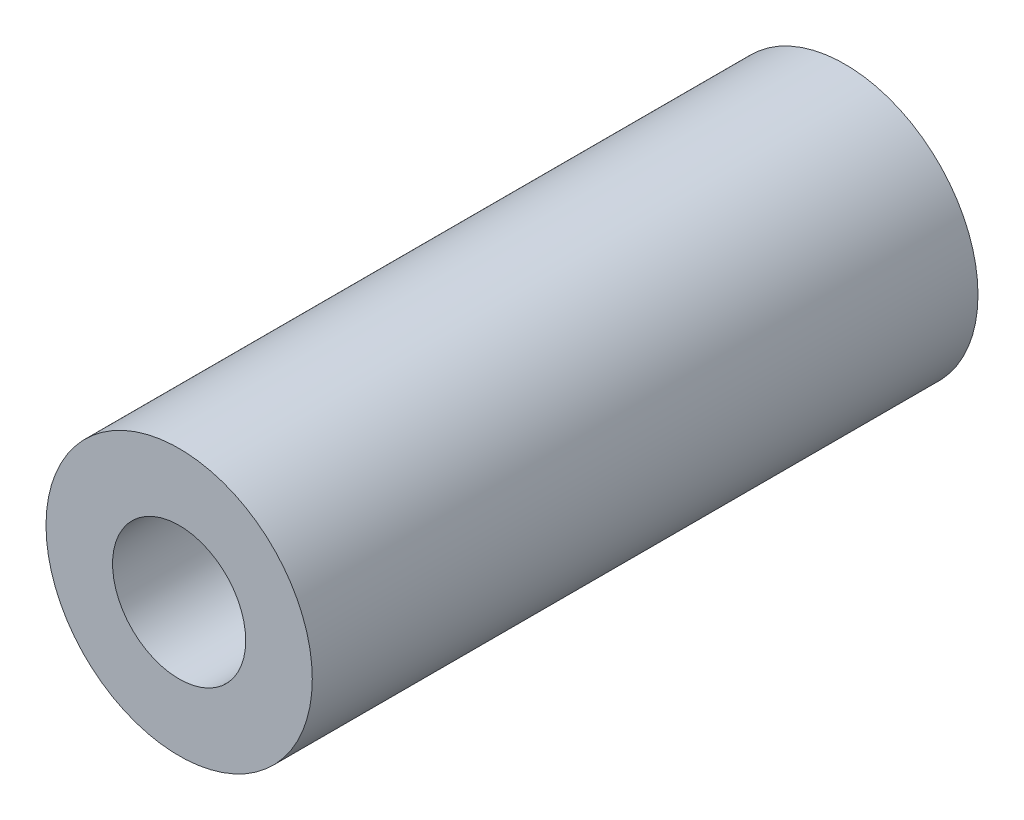
ISO-10303-21;
HEADER;
FILE_DESCRIPTION(('STEP AP214'),'2;1');
FILE_NAME('part.step','',(''),(''),'','','');
FILE_SCHEMA(('AUTOMOTIVE_DESIGN { 1 0 10303 214 1 1 1 1 }'));
ENDSEC;
DATA;
#1=APPLICATION_CONTEXT('core data for automotive mechanical design processes');
#2=APPLICATION_PROTOCOL_DEFINITION('international standard','automotive_design',2000,#1);
#3=PRODUCT_CONTEXT('',#1,'mechanical');
#4=PRODUCT('Part','Part','',(#3));
#5=PRODUCT_RELATED_PRODUCT_CATEGORY('part','',(#4));
#6=PRODUCT_DEFINITION_FORMATION('','',#4);
#7=PRODUCT_DEFINITION_CONTEXT('part definition',#1,'design');
#8=PRODUCT_DEFINITION('design','',#6,#7);
#9=PRODUCT_DEFINITION_SHAPE('','',#8);
#10=(LENGTH_UNIT() NAMED_UNIT(*) SI_UNIT(.MILLI.,.METRE.));
#11=(NAMED_UNIT(*) PLANE_ANGLE_UNIT() SI_UNIT($,.RADIAN.));
#12=(NAMED_UNIT(*) SI_UNIT($,.STERADIAN.) SOLID_ANGLE_UNIT());
#13=UNCERTAINTY_MEASURE_WITH_UNIT(LENGTH_MEASURE(1.E-05),#10,'distance_accuracy_value','');
#14=(GEOMETRIC_REPRESENTATION_CONTEXT(3) GLOBAL_UNCERTAINTY_ASSIGNED_CONTEXT((#13)) GLOBAL_UNIT_ASSIGNED_CONTEXT((#10,
#11,#12)) REPRESENTATION_CONTEXT('',''));
#15=CARTESIAN_POINT('',(0.,0.,0.));
#16=DIRECTION('',(0.,0.,1.));
#17=DIRECTION('',(1.,0.,0.));
#18=AXIS2_PLACEMENT_3D('',#15,#16,#17);
#19=CARTESIAN_POINT('',(0.,0.,20.));
#20=DIRECTION('',(0.,0.,-1.));
#21=DIRECTION('',(-1.,0.,0.));
#22=AXIS2_PLACEMENT_3D('',#19,#20,#21);
#23=CYLINDRICAL_SURFACE('',#22,8.);
#24=CARTESIAN_POINT('',(0.,0.,20.));
#25=DIRECTION('',(0.,0.,1.));
#26=DIRECTION('',(1.,0.,0.));
#27=AXIS2_PLACEMENT_3D('',#24,#25,#26);
#28=CIRCLE('',#27,8.);
#29=CARTESIAN_POINT('',(8.,0.,20.));
#30=VERTEX_POINT('',#29);
#31=EDGE_CURVE('E10',#30,#30,#28,.T.);
#32=ORIENTED_EDGE('',*,*,#31,.F.);
#33=EDGE_LOOP('',(#32));
#34=FACE_BOUND('',#33,.T.);
#35=CARTESIAN_POINT('',(0.,0.,-20.));
#36=DIRECTION('',(0.,0.,1.));
#37=DIRECTION('',(1.,0.,0.));
#38=AXIS2_PLACEMENT_3D('',#35,#36,#37);
#39=CIRCLE('',#38,8.);
#40=CARTESIAN_POINT('',(8.,0.,-20.));
#41=VERTEX_POINT('',#40);
#42=EDGE_CURVE('E48',#41,#41,#39,.T.);
#43=ORIENTED_EDGE('',*,*,#42,.T.);
#44=EDGE_LOOP('',(#43));
#45=FACE_BOUND('',#44,.T.);
#46=ADVANCED_FACE('F33',(#34,#45),#23,.T.);
#47=CARTESIAN_POINT('',(0.,0.,20.));
#48=DIRECTION('',(0.,0.,1.));
#49=DIRECTION('',(1.,0.,0.));
#50=AXIS2_PLACEMENT_3D('',#47,#48,#49);
#51=PLANE('',#50);
#52=CARTESIAN_POINT('',(0.,0.,20.));
#53=DIRECTION('',(0.,0.,1.));
#54=DIRECTION('',(1.,0.,0.));
#55=AXIS2_PLACEMENT_3D('',#52,#53,#54);
#56=CIRCLE('',#55,4.);
#57=CARTESIAN_POINT('',(4.,0.,20.));
#58=VERTEX_POINT('',#57);
#59=EDGE_CURVE('E43',#58,#58,#56,.T.);
#60=ORIENTED_EDGE('',*,*,#59,.F.);
#61=EDGE_LOOP('',(#60));
#62=FACE_BOUND('',#61,.T.);
#63=ORIENTED_EDGE('',*,*,#31,.T.);
#64=EDGE_LOOP('',(#63));
#65=FACE_BOUND('',#64,.T.);
#66=ADVANCED_FACE('F71',(#62,#65),#51,.T.);
#67=CARTESIAN_POINT('',(0.,0.,7.));
#68=DIRECTION('',(0.,0.,1.));
#69=DIRECTION('',(1.,0.,0.));
#70=AXIS2_PLACEMENT_3D('',#67,#68,#69);
#71=CYLINDRICAL_SURFACE('',#70,4.);
#72=CARTESIAN_POINT('',(0.,0.,7.));
#73=DIRECTION('',(0.,0.,1.));
#74=DIRECTION('',(1.,0.,0.));
#75=AXIS2_PLACEMENT_3D('',#72,#73,#74);
#76=CIRCLE('',#75,4.);
#77=CARTESIAN_POINT('',(4.,0.,7.));
#78=VERTEX_POINT('',#77);
#79=EDGE_CURVE('E39',#78,#78,#76,.T.);
#80=ORIENTED_EDGE('',*,*,#79,.F.);
#81=EDGE_LOOP('',(#80));
#82=FACE_BOUND('',#81,.T.);
#83=ORIENTED_EDGE('',*,*,#59,.T.);
#84=EDGE_LOOP('',(#83));
#85=FACE_BOUND('',#84,.T.);
#86=ADVANCED_FACE('F76',(#82,#85),#71,.F.);
#87=CARTESIAN_POINT('',(0.,0.,7.));
#88=DIRECTION('',(0.,0.,1.));
#89=DIRECTION('',(1.,0.,0.));
#90=AXIS2_PLACEMENT_3D('',#87,#88,#89);
#91=PLANE('',#90);
#92=ORIENTED_EDGE('',*,*,#79,.T.);
#93=EDGE_LOOP('',(#92));
#94=FACE_BOUND('',#93,.T.);
#95=ADVANCED_FACE('F82',(#94),#91,.T.);
#96=CARTESIAN_POINT('',(0.,0.,-20.));
#97=DIRECTION('',(0.,0.,-1.));
#98=DIRECTION('',(1.,0.,0.));
#99=AXIS2_PLACEMENT_3D('',#96,#97,#98);
#100=PLANE('',#99);
#101=CARTESIAN_POINT('',(0.,0.,-20.));
#102=DIRECTION('',(0.,0.,1.));
#103=DIRECTION('',(1.,0.,0.));
#104=AXIS2_PLACEMENT_3D('',#101,#102,#103);
#105=CIRCLE('',#104,4.);
#106=CARTESIAN_POINT('',(4.,0.,-20.));
#107=VERTEX_POINT('',#106);
#108=EDGE_CURVE('E53',#107,#107,#105,.T.);
#109=ORIENTED_EDGE('',*,*,#108,.T.);
#110=EDGE_LOOP('',(#109));
#111=FACE_BOUND('',#110,.T.);
#112=ORIENTED_EDGE('',*,*,#42,.F.);
#113=EDGE_LOOP('',(#112));
#114=FACE_BOUND('',#113,.T.);
#115=ADVANCED_FACE('F68',(#111,#114),#100,.T.);
#116=CARTESIAN_POINT('',(0.,0.,-7.));
#117=DIRECTION('',(0.,0.,-1.));
#118=DIRECTION('',(1.,0.,0.));
#119=AXIS2_PLACEMENT_3D('',#116,#117,#118);
#120=CYLINDRICAL_SURFACE('',#119,4.);
#121=CARTESIAN_POINT('',(0.,0.,-7.));
#122=DIRECTION('',(0.,0.,1.));
#123=DIRECTION('',(1.,0.,0.));
#124=AXIS2_PLACEMENT_3D('',#121,#122,#123);
#125=CIRCLE('',#124,4.);
#126=CARTESIAN_POINT('',(4.,0.,-7.));
#127=VERTEX_POINT('',#126);
#128=EDGE_CURVE('E52',#127,#127,#125,.T.);
#129=ORIENTED_EDGE('',*,*,#128,.T.);
#130=EDGE_LOOP('',(#129));
#131=FACE_BOUND('',#130,.T.);
#132=ORIENTED_EDGE('',*,*,#108,.F.);
#133=EDGE_LOOP('',(#132));
#134=FACE_BOUND('',#133,.T.);
#135=ADVANCED_FACE('F59',(#131,#134),#120,.F.);
#136=CARTESIAN_POINT('',(0.,0.,-7.));
#137=DIRECTION('',(0.,0.,-1.));
#138=DIRECTION('',(1.,0.,0.));
#139=AXIS2_PLACEMENT_3D('',#136,#137,#138);
#140=PLANE('',#139);
#141=ORIENTED_EDGE('',*,*,#128,.F.);
#142=EDGE_LOOP('',(#141));
#143=FACE_BOUND('',#142,.T.);
#144=ADVANCED_FACE('F62',(#143),#140,.T.);
#145=CLOSED_SHELL('',(#46,#66,#86,#95,#115,#135,#144));
#146=MANIFOLD_SOLID_BREP('B2',#145);
#147=ADVANCED_BREP_SHAPE_REPRESENTATION('',(#18,#146),#14);
#148=SHAPE_DEFINITION_REPRESENTATION(#9,#147);
ENDSEC;
END-ISO-10303-21;
